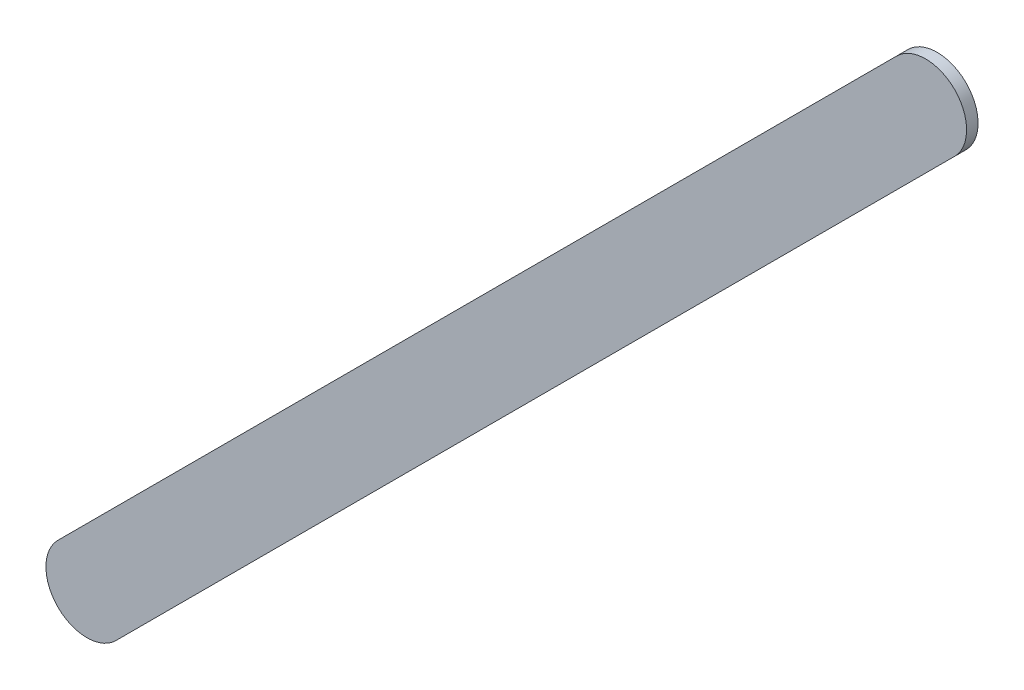
ISO-10303-21;
HEADER;
FILE_DESCRIPTION(('STEP AP214'),'2;1');
FILE_NAME('part.step','',(''),(''),'','','');
FILE_SCHEMA(('AUTOMOTIVE_DESIGN { 1 0 10303 214 1 1 1 1 }'));
ENDSEC;
DATA;
#1=APPLICATION_CONTEXT('core data for automotive mechanical design processes');
#2=APPLICATION_PROTOCOL_DEFINITION('international standard','automotive_design',2000,#1);
#3=PRODUCT_CONTEXT('',#1,'mechanical');
#4=PRODUCT('Part','Part','',(#3));
#5=PRODUCT_RELATED_PRODUCT_CATEGORY('part','',(#4));
#6=PRODUCT_DEFINITION_FORMATION('','',#4);
#7=PRODUCT_DEFINITION_CONTEXT('part definition',#1,'design');
#8=PRODUCT_DEFINITION('design','',#6,#7);
#9=PRODUCT_DEFINITION_SHAPE('','',#8);
#10=(LENGTH_UNIT() NAMED_UNIT(*) SI_UNIT(.MILLI.,.METRE.));
#11=(NAMED_UNIT(*) PLANE_ANGLE_UNIT() SI_UNIT($,.RADIAN.));
#12=(NAMED_UNIT(*) SI_UNIT($,.STERADIAN.) SOLID_ANGLE_UNIT());
#13=UNCERTAINTY_MEASURE_WITH_UNIT(LENGTH_MEASURE(1.E-05),#10,'distance_accuracy_value','');
#14=(GEOMETRIC_REPRESENTATION_CONTEXT(3) GLOBAL_UNCERTAINTY_ASSIGNED_CONTEXT((#13)) GLOBAL_UNIT_ASSIGNED_CONTEXT((#10,
#11,#12)) REPRESENTATION_CONTEXT('',''));
#15=CARTESIAN_POINT('',(0.,0.,0.));
#16=DIRECTION('',(0.,0.,1.));
#17=DIRECTION('',(1.,0.,0.));
#18=AXIS2_PLACEMENT_3D('',#15,#16,#17);
#19=CARTESIAN_POINT('',(100.20677444,84.79717102,0.));
#20=DIRECTION('',(-0.70710678118655,0.707106781186546,0.));
#21=DIRECTION('',(0.707106781186546,0.70710678118655,0.));
#22=AXIS2_PLACEMENT_3D('',#19,#20,#21);
#23=PLANE('',#22);
#24=DIRECTION('',(0.707106781186546,0.70710678118655,0.));
#25=VECTOR('',#24,1.);
#26=CARTESIAN_POINT('',(100.20677444,84.79717102,0.03556));
#27=LINE('',#26,#25);
#28=CARTESIAN_POINT('',(100.20677444,84.79717102,0.03556));
#29=VERTEX_POINT('',#28);
#30=CARTESIAN_POINT('',(102.80677432,87.3971709,0.03556));
#31=VERTEX_POINT('',#30);
#32=EDGE_CURVE('E11',#29,#31,#27,.T.);
#33=ORIENTED_EDGE('',*,*,#32,.F.);
#34=DIRECTION('',(0.,0.,1.));
#35=VECTOR('',#34,1.);
#36=CARTESIAN_POINT('',(100.20677444,84.79717102,0.));
#37=LINE('',#36,#35);
#38=CARTESIAN_POINT('',(100.20677444,84.79717102,0.));
#39=VERTEX_POINT('',#38);
#40=EDGE_CURVE('E24',#39,#29,#37,.T.);
#41=ORIENTED_EDGE('',*,*,#40,.F.);
#42=DIRECTION('',(0.707106781186546,0.70710678118655,0.));
#43=VECTOR('',#42,1.);
#44=CARTESIAN_POINT('',(100.20677444,84.79717102,0.));
#45=LINE('',#44,#43);
#46=CARTESIAN_POINT('',(102.80677432,87.3971709,0.));
#47=VERTEX_POINT('',#46);
#48=EDGE_CURVE('E75',#39,#47,#45,.T.);
#49=ORIENTED_EDGE('',*,*,#48,.T.);
#50=DIRECTION('',(0.,0.,1.));
#51=VECTOR('',#50,1.);
#52=CARTESIAN_POINT('',(102.80677432,87.3971709,0.));
#53=LINE('',#52,#51);
#54=EDGE_CURVE('E37',#47,#31,#53,.T.);
#55=ORIENTED_EDGE('',*,*,#54,.T.);
#56=EDGE_LOOP('',(#33,#41,#49,#55));
#57=FACE_BOUND('',#56,.T.);
#58=ADVANCED_FACE('F17',(#57),#23,.F.);
#59=CARTESIAN_POINT('',(102.71697262,87.4869726,0.));
#60=DIRECTION('',(0.,0.,-1.));
#61=DIRECTION('',(0.707106781186492,-0.707106781186604,0.));
#62=AXIS2_PLACEMENT_3D('',#59,#60,#61);
#63=CYLINDRICAL_SURFACE('',#62,0.126998782064157);
#64=CARTESIAN_POINT('',(102.71697262,87.4869726,0.03556));
#65=DIRECTION('',(0.,0.,1.));
#66=DIRECTION('',(0.707106781186492,-0.707106781186604,0.));
#67=AXIS2_PLACEMENT_3D('',#64,#65,#66);
#68=CIRCLE('',#67,0.126998782064157);
#69=CARTESIAN_POINT('',(102.62717092,87.5767743,0.03556));
#70=VERTEX_POINT('',#69);
#71=EDGE_CURVE('E83',#31,#70,#68,.T.);
#72=ORIENTED_EDGE('',*,*,#71,.F.);
#73=ORIENTED_EDGE('',*,*,#54,.F.);
#74=CARTESIAN_POINT('',(102.71697262,87.4869726,0.));
#75=DIRECTION('',(0.,0.,1.));
#76=DIRECTION('',(0.707106781186492,-0.707106781186604,0.));
#77=AXIS2_PLACEMENT_3D('',#74,#75,#76);
#78=CIRCLE('',#77,0.126998782064157);
#79=CARTESIAN_POINT('',(102.62717092,87.5767743,0.));
#80=VERTEX_POINT('',#79);
#81=EDGE_CURVE('E81',#47,#80,#78,.T.);
#82=ORIENTED_EDGE('',*,*,#81,.T.);
#83=DIRECTION('',(0.,0.,1.));
#84=VECTOR('',#83,1.);
#85=CARTESIAN_POINT('',(102.62717092,87.5767743,0.));
#86=LINE('',#85,#84);
#87=EDGE_CURVE('E67',#80,#70,#86,.T.);
#88=ORIENTED_EDGE('',*,*,#87,.T.);
#89=EDGE_LOOP('',(#72,#73,#82,#88));
#90=FACE_BOUND('',#89,.T.);
#91=ADVANCED_FACE('F89',(#90),#63,.T.);
#92=CARTESIAN_POINT('',(102.62717092,87.5767743,0.));
#93=DIRECTION('',(0.707106781186548,-0.707106781186548,0.));
#94=DIRECTION('',(-0.707106781186548,-0.707106781186548,0.));
#95=AXIS2_PLACEMENT_3D('',#92,#93,#94);
#96=PLANE('',#95);
#97=DIRECTION('',(-0.707106781186548,-0.707106781186548,0.));
#98=VECTOR('',#97,1.);
#99=CARTESIAN_POINT('',(102.62717092,87.5767743,0.03556));
#100=LINE('',#99,#98);
#101=CARTESIAN_POINT('',(100.02717104,84.97677442,0.03556));
#102=VERTEX_POINT('',#101);
#103=EDGE_CURVE('E71',#70,#102,#100,.T.);
#104=ORIENTED_EDGE('',*,*,#103,.F.);
#105=ORIENTED_EDGE('',*,*,#87,.F.);
#106=DIRECTION('',(-0.707106781186548,-0.707106781186548,0.));
#107=VECTOR('',#106,1.);
#108=CARTESIAN_POINT('',(102.62717092,87.5767743,0.));
#109=LINE('',#108,#107);
#110=CARTESIAN_POINT('',(100.02717104,84.97677442,0.));
#111=VERTEX_POINT('',#110);
#112=EDGE_CURVE('E63',#80,#111,#109,.T.);
#113=ORIENTED_EDGE('',*,*,#112,.T.);
#114=DIRECTION('',(0.,0.,1.));
#115=VECTOR('',#114,1.);
#116=CARTESIAN_POINT('',(100.02717104,84.97677442,0.));
#117=LINE('',#116,#115);
#118=EDGE_CURVE('E53',#111,#102,#117,.T.);
#119=ORIENTED_EDGE('',*,*,#118,.T.);
#120=EDGE_LOOP('',(#104,#105,#113,#119));
#121=FACE_BOUND('',#120,.T.);
#122=ADVANCED_FACE('F66',(#121),#96,.F.);
#123=CARTESIAN_POINT('',(100.11697274,84.88697272,0.));
#124=DIRECTION('',(0.,0.,-1.));
#125=DIRECTION('',(-0.707106781186492,0.707106781186604,0.));
#126=AXIS2_PLACEMENT_3D('',#123,#124,#125);
#127=CYLINDRICAL_SURFACE('',#126,0.12699878206416);
#128=CARTESIAN_POINT('',(100.11697274,84.88697272,0.03556));
#129=DIRECTION('',(0.,0.,1.));
#130=DIRECTION('',(-0.707106781186492,0.707106781186604,0.));
#131=AXIS2_PLACEMENT_3D('',#128,#129,#130);
#132=CIRCLE('',#131,0.12699878206416);
#133=EDGE_CURVE('E59',#102,#29,#132,.T.);
#134=ORIENTED_EDGE('',*,*,#133,.F.);
#135=ORIENTED_EDGE('',*,*,#118,.F.);
#136=CARTESIAN_POINT('',(100.11697274,84.88697272,0.));
#137=DIRECTION('',(0.,0.,1.));
#138=DIRECTION('',(-0.707106781186492,0.707106781186604,0.));
#139=AXIS2_PLACEMENT_3D('',#136,#137,#138);
#140=CIRCLE('',#139,0.12699878206416);
#141=EDGE_CURVE('E57',#111,#39,#140,.T.);
#142=ORIENTED_EDGE('',*,*,#141,.T.);
#143=ORIENTED_EDGE('',*,*,#40,.T.);
#144=EDGE_LOOP('',(#134,#135,#142,#143));
#145=FACE_BOUND('',#144,.T.);
#146=ADVANCED_FACE('F55',(#145),#127,.T.);
#147=CARTESIAN_POINT('',(100.20677444,84.79717102,0.));
#148=DIRECTION('',(0.,0.,-1.));
#149=DIRECTION('',(-1.,0.,0.));
#150=AXIS2_PLACEMENT_3D('',#147,#148,#149);
#151=PLANE('',#150);
#152=ORIENTED_EDGE('',*,*,#141,.F.);
#153=ORIENTED_EDGE('',*,*,#112,.F.);
#154=ORIENTED_EDGE('',*,*,#81,.F.);
#155=ORIENTED_EDGE('',*,*,#48,.F.);
#156=EDGE_LOOP('',(#152,#153,#154,#155));
#157=FACE_BOUND('',#156,.T.);
#158=ADVANCED_FACE('F74',(#157),#151,.T.);
#159=CARTESIAN_POINT('',(100.20677444,84.79717102,0.03556));
#160=DIRECTION('',(0.,0.,-1.));
#161=DIRECTION('',(-1.,0.,0.));
#162=AXIS2_PLACEMENT_3D('',#159,#160,#161);
#163=PLANE('',#162);
#164=ORIENTED_EDGE('',*,*,#32,.T.);
#165=ORIENTED_EDGE('',*,*,#71,.T.);
#166=ORIENTED_EDGE('',*,*,#103,.T.);
#167=ORIENTED_EDGE('',*,*,#133,.T.);
#168=EDGE_LOOP('',(#164,#165,#166,#167));
#169=FACE_BOUND('',#168,.T.);
#170=ADVANCED_FACE('F91',(#169),#163,.F.);
#171=CLOSED_SHELL('',(#58,#91,#122,#146,#158,#170));
#172=MANIFOLD_SOLID_BREP('B1',#171);
#173=ADVANCED_BREP_SHAPE_REPRESENTATION('',(#18,#172),#14);
#174=SHAPE_DEFINITION_REPRESENTATION(#9,#173);
ENDSEC;
END-ISO-10303-21;
